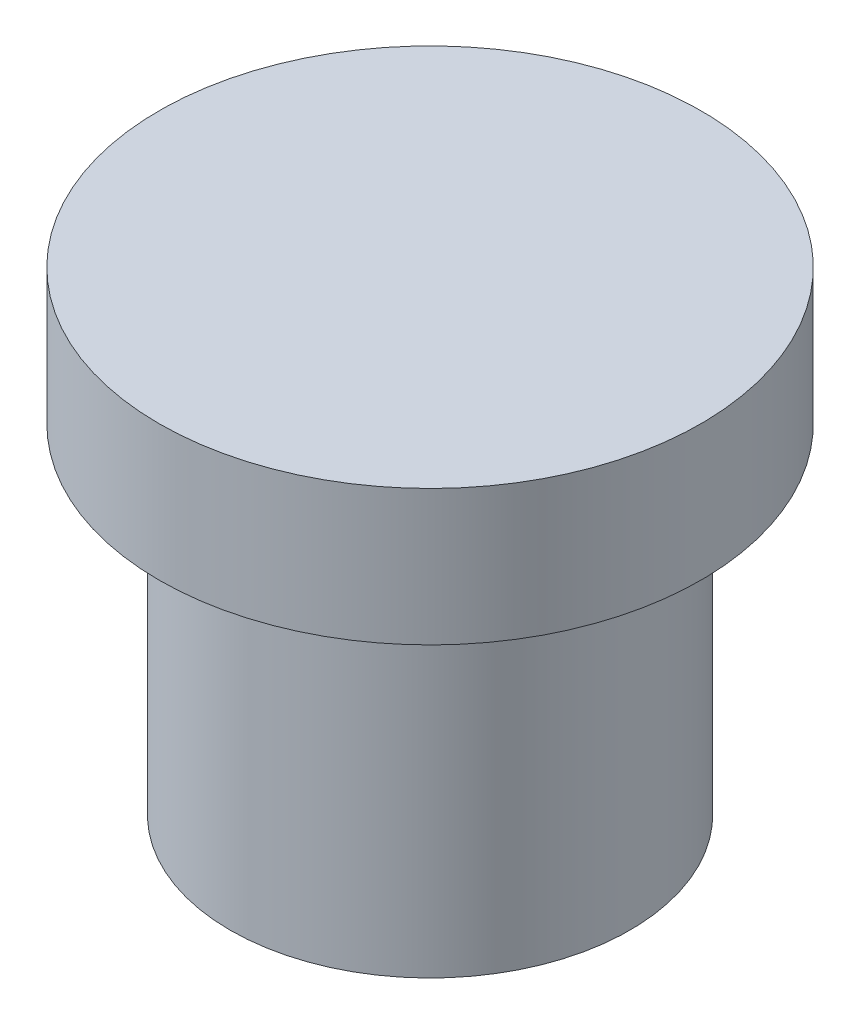
ISO-10303-21;
HEADER;
FILE_DESCRIPTION(('STEP AP214'),'2;1');
FILE_NAME('part.step','',(''),(''),'','','');
FILE_SCHEMA(('AUTOMOTIVE_DESIGN { 1 0 10303 214 1 1 1 1 }'));
ENDSEC;
DATA;
#1=APPLICATION_CONTEXT('core data for automotive mechanical design processes');
#2=APPLICATION_PROTOCOL_DEFINITION('international standard','automotive_design',2000,#1);
#3=PRODUCT_CONTEXT('',#1,'mechanical');
#4=PRODUCT('Part','Part','',(#3));
#5=PRODUCT_RELATED_PRODUCT_CATEGORY('part','',(#4));
#6=PRODUCT_DEFINITION_FORMATION('','',#4);
#7=PRODUCT_DEFINITION_CONTEXT('part definition',#1,'design');
#8=PRODUCT_DEFINITION('design','',#6,#7);
#9=PRODUCT_DEFINITION_SHAPE('','',#8);
#10=(LENGTH_UNIT() NAMED_UNIT(*) SI_UNIT(.MILLI.,.METRE.));
#11=(NAMED_UNIT(*) PLANE_ANGLE_UNIT() SI_UNIT($,.RADIAN.));
#12=(NAMED_UNIT(*) SI_UNIT($,.STERADIAN.) SOLID_ANGLE_UNIT());
#13=UNCERTAINTY_MEASURE_WITH_UNIT(LENGTH_MEASURE(1.E-05),#10,'distance_accuracy_value','');
#14=(GEOMETRIC_REPRESENTATION_CONTEXT(3) GLOBAL_UNCERTAINTY_ASSIGNED_CONTEXT((#13)) GLOBAL_UNIT_ASSIGNED_CONTEXT((#10,
#11,#12)) REPRESENTATION_CONTEXT('',''));
#15=CARTESIAN_POINT('',(0.,0.,0.));
#16=DIRECTION('',(0.,0.,1.));
#17=DIRECTION('',(1.,0.,0.));
#18=AXIS2_PLACEMENT_3D('',#15,#16,#17);
#19=CARTESIAN_POINT('',(0.,5.,0.));
#20=DIRECTION('',(0.,-1.,0.));
#21=DIRECTION('',(0.,0.,-1.));
#22=AXIS2_PLACEMENT_3D('',#19,#20,#21);
#23=CYLINDRICAL_SURFACE('',#22,2.95);
#24=CARTESIAN_POINT('',(0.,5.,0.));
#25=DIRECTION('',(0.,1.,0.));
#26=DIRECTION('',(0.,0.,1.));
#27=AXIS2_PLACEMENT_3D('',#24,#25,#26);
#28=CIRCLE('',#27,2.95);
#29=CARTESIAN_POINT('',(0.,5.,2.95));
#30=VERTEX_POINT('',#29);
#31=EDGE_CURVE('E10',#30,#30,#28,.T.);
#32=ORIENTED_EDGE('',*,*,#31,.F.);
#33=EDGE_LOOP('',(#32));
#34=FACE_BOUND('',#33,.T.);
#35=CARTESIAN_POINT('',(0.,0.,0.));
#36=DIRECTION('',(0.,1.,0.));
#37=DIRECTION('',(0.,0.,1.));
#38=AXIS2_PLACEMENT_3D('',#35,#36,#37);
#39=CIRCLE('',#38,2.95);
#40=CARTESIAN_POINT('',(0.,0.,2.95));
#41=VERTEX_POINT('',#40);
#42=EDGE_CURVE('E36',#41,#41,#39,.T.);
#43=ORIENTED_EDGE('',*,*,#42,.T.);
#44=EDGE_LOOP('',(#43));
#45=FACE_BOUND('',#44,.T.);
#46=ADVANCED_FACE('F33',(#34,#45),#23,.T.);
#47=CARTESIAN_POINT('',(0.,0.,0.));
#48=DIRECTION('',(0.,1.,0.));
#49=DIRECTION('',(0.,0.,1.));
#50=AXIS2_PLACEMENT_3D('',#47,#48,#49);
#51=PLANE('',#50);
#52=ORIENTED_EDGE('',*,*,#42,.F.);
#53=EDGE_LOOP('',(#52));
#54=FACE_BOUND('',#53,.T.);
#55=ADVANCED_FACE('F56',(#54),#51,.F.);
#56=CARTESIAN_POINT('',(0.,7.,0.));
#57=DIRECTION('',(0.,-1.,0.));
#58=DIRECTION('',(0.,0.,-1.));
#59=AXIS2_PLACEMENT_3D('',#56,#57,#58);
#60=CYLINDRICAL_SURFACE('',#59,4.);
#61=CARTESIAN_POINT('',(0.,7.,0.));
#62=DIRECTION('',(0.,1.,0.));
#63=DIRECTION('',(0.,0.,1.));
#64=AXIS2_PLACEMENT_3D('',#61,#62,#63);
#65=CIRCLE('',#64,4.);
#66=CARTESIAN_POINT('',(0.,7.,4.));
#67=VERTEX_POINT('',#66);
#68=EDGE_CURVE('E43',#67,#67,#65,.T.);
#69=ORIENTED_EDGE('',*,*,#68,.F.);
#70=EDGE_LOOP('',(#69));
#71=FACE_BOUND('',#70,.T.);
#72=CARTESIAN_POINT('',(0.,5.,0.));
#73=DIRECTION('',(0.,1.,0.));
#74=DIRECTION('',(0.,0.,1.));
#75=AXIS2_PLACEMENT_3D('',#72,#73,#74);
#76=CIRCLE('',#75,4.);
#77=CARTESIAN_POINT('',(0.,5.,4.));
#78=VERTEX_POINT('',#77);
#79=EDGE_CURVE('E45',#78,#78,#76,.T.);
#80=ORIENTED_EDGE('',*,*,#79,.T.);
#81=EDGE_LOOP('',(#80));
#82=FACE_BOUND('',#81,.T.);
#83=ADVANCED_FACE('F53',(#71,#82),#60,.T.);
#84=CARTESIAN_POINT('',(0.,7.,0.));
#85=DIRECTION('',(0.,1.,0.));
#86=DIRECTION('',(0.,0.,1.));
#87=AXIS2_PLACEMENT_3D('',#84,#85,#86);
#88=PLANE('',#87);
#89=ORIENTED_EDGE('',*,*,#68,.T.);
#90=EDGE_LOOP('',(#89));
#91=FACE_BOUND('',#90,.T.);
#92=ADVANCED_FACE('F51',(#91),#88,.T.);
#93=CARTESIAN_POINT('',(0.,5.,0.));
#94=DIRECTION('',(0.,1.,0.));
#95=DIRECTION('',(0.,0.,1.));
#96=AXIS2_PLACEMENT_3D('',#93,#94,#95);
#97=PLANE('',#96);
#98=ORIENTED_EDGE('',*,*,#31,.T.);
#99=EDGE_LOOP('',(#98));
#100=FACE_BOUND('',#99,.T.);
#101=ORIENTED_EDGE('',*,*,#79,.F.);
#102=EDGE_LOOP('',(#101));
#103=FACE_BOUND('',#102,.T.);
#104=ADVANCED_FACE('F60',(#100,#103),#97,.F.);
#105=CLOSED_SHELL('',(#46,#55,#83,#92,#104));
#106=MANIFOLD_SOLID_BREP('B2',#105);
#107=ADVANCED_BREP_SHAPE_REPRESENTATION('',(#18,#106),#14);
#108=SHAPE_DEFINITION_REPRESENTATION(#9,#107);
ENDSEC;
END-ISO-10303-21;
